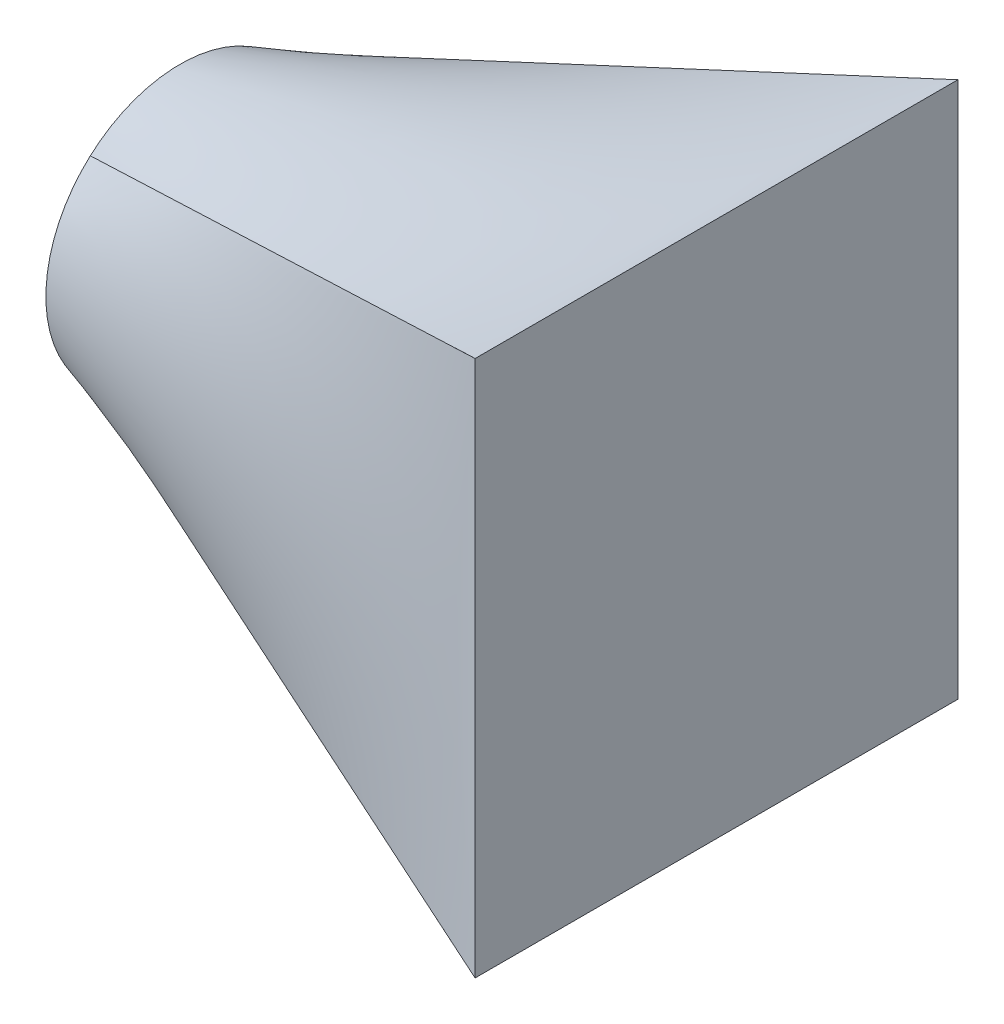
ISO-10303-21;
HEADER;
FILE_DESCRIPTION(('STEP AP214'),'2;1');
FILE_NAME('part.step','',(''),(''),'','','');
FILE_SCHEMA(('AUTOMOTIVE_DESIGN { 1 0 10303 214 1 1 1 1 }'));
ENDSEC;
DATA;
#1=APPLICATION_CONTEXT('core data for automotive mechanical design processes');
#2=APPLICATION_PROTOCOL_DEFINITION('international standard','automotive_design',2000,#1);
#3=PRODUCT_CONTEXT('',#1,'mechanical');
#4=PRODUCT('Part','Part','',(#3));
#5=PRODUCT_RELATED_PRODUCT_CATEGORY('part','',(#4));
#6=PRODUCT_DEFINITION_FORMATION('','',#4);
#7=PRODUCT_DEFINITION_CONTEXT('part definition',#1,'design');
#8=PRODUCT_DEFINITION('design','',#6,#7);
#9=PRODUCT_DEFINITION_SHAPE('','',#8);
#10=(LENGTH_UNIT() NAMED_UNIT(*) SI_UNIT(.MILLI.,.METRE.));
#11=(NAMED_UNIT(*) PLANE_ANGLE_UNIT() SI_UNIT($,.RADIAN.));
#12=(NAMED_UNIT(*) SI_UNIT($,.STERADIAN.) SOLID_ANGLE_UNIT());
#13=UNCERTAINTY_MEASURE_WITH_UNIT(LENGTH_MEASURE(1.E-05),#10,'distance_accuracy_value','');
#14=(GEOMETRIC_REPRESENTATION_CONTEXT(3) GLOBAL_UNCERTAINTY_ASSIGNED_CONTEXT((#13)) GLOBAL_UNIT_ASSIGNED_CONTEXT((#10,
#11,#12)) REPRESENTATION_CONTEXT('',''));
#15=CARTESIAN_POINT('',(0.,0.,0.));
#16=DIRECTION('',(0.,0.,1.));
#17=DIRECTION('',(1.,0.,0.));
#18=AXIS2_PLACEMENT_3D('',#15,#16,#17);
#19=CARTESIAN_POINT('',(100.,0.,0.));
#20=DIRECTION('',(1.,0.,0.));
#21=DIRECTION('',(0.,0.,-1.));
#22=AXIS2_PLACEMENT_3D('',#19,#20,#21);
#23=PLANE('',#22);
#24=DIRECTION('',(0.,1.,0.));
#25=VECTOR('',#24,1.);
#26=CARTESIAN_POINT('',(100.,50.,-45.));
#27=LINE('',#26,#25);
#28=CARTESIAN_POINT('',(100.,-50.,-45.));
#29=VERTEX_POINT('',#28);
#30=CARTESIAN_POINT('',(100.,50.,-45.));
#31=VERTEX_POINT('',#30);
#32=EDGE_CURVE('E138',#29,#31,#27,.T.);
#33=ORIENTED_EDGE('',*,*,#32,.T.);
#34=DIRECTION('',(0.,0.,1.));
#35=VECTOR('',#34,1.);
#36=CARTESIAN_POINT('',(100.,50.,45.));
#37=LINE('',#36,#35);
#38=CARTESIAN_POINT('',(100.,50.,45.));
#39=VERTEX_POINT('',#38);
#40=EDGE_CURVE('E12',#31,#39,#37,.T.);
#41=ORIENTED_EDGE('',*,*,#40,.T.);
#42=DIRECTION('',(0.,-1.,0.));
#43=VECTOR('',#42,1.);
#44=CARTESIAN_POINT('',(100.,50.,45.));
#45=LINE('',#44,#43);
#46=CARTESIAN_POINT('',(100.,-50.,45.));
#47=VERTEX_POINT('',#46);
#48=EDGE_CURVE('E75',#39,#47,#45,.T.);
#49=ORIENTED_EDGE('',*,*,#48,.T.);
#50=DIRECTION('',(0.,0.,-1.));
#51=VECTOR('',#50,1.);
#52=CARTESIAN_POINT('',(100.,-50.,45.));
#53=LINE('',#52,#51);
#54=EDGE_CURVE('E243',#47,#29,#53,.T.);
#55=ORIENTED_EDGE('',*,*,#54,.T.);
#56=EDGE_LOOP('',(#33,#41,#49,#55));
#57=FACE_BOUND('',#56,.T.);
#58=ADVANCED_FACE('F65',(#57),#23,.T.);
#59=CARTESIAN_POINT('',(0.,0.,0.));
#60=DIRECTION('',(1.,0.,0.));
#61=DIRECTION('',(0.,0.,-1.));
#62=AXIS2_PLACEMENT_3D('',#59,#60,#61);
#63=PLANE('',#62);
#64=CARTESIAN_POINT('',(0.,0.,0.));
#65=DIRECTION('',(1.,0.,0.));
#66=DIRECTION('',(0.,0.,-1.));
#67=AXIS2_PLACEMENT_3D('',#64,#65,#66);
#68=CIRCLE('',#67,25.);
#69=CARTESIAN_POINT('',(0.,18.5823536561792,-16.7241182905612));
#70=VERTEX_POINT('',#69);
#71=CARTESIAN_POINT('',(0.,18.5823536561792,16.7241182905612));
#72=VERTEX_POINT('',#71);
#73=EDGE_CURVE('E111',#70,#72,#68,.T.);
#74=ORIENTED_EDGE('',*,*,#73,.F.);
#75=CARTESIAN_POINT('',(0.,-18.5823536561792,-16.7241182905612));
#76=VERTEX_POINT('',#75);
#77=EDGE_CURVE('E115',#76,#70,#68,.T.);
#78=ORIENTED_EDGE('',*,*,#77,.F.);
#79=CARTESIAN_POINT('',(0.,-18.5823536561792,16.7241182905612));
#80=VERTEX_POINT('',#79);
#81=EDGE_CURVE('E131',#80,#76,#68,.T.);
#82=ORIENTED_EDGE('',*,*,#81,.F.);
#83=EDGE_CURVE('E117',#72,#80,#68,.T.);
#84=ORIENTED_EDGE('',*,*,#83,.F.);
#85=EDGE_LOOP('',(#74,#78,#82,#84));
#86=FACE_BOUND('',#85,.T.);
#87=ADVANCED_FACE('F113',(#86),#63,.F.);
#88=CARTESIAN_POINT('',(0.,-18.5823536561792,16.7241182905612));
#89=CARTESIAN_POINT('',(100.,-50.,45.));
#90=CARTESIAN_POINT('',(0.,-19.5146740981681,15.6882066883513));
#91=CARTESIAN_POINT('',(100.,-50.,41.25));
#92=CARTESIAN_POINT('',(0.,-20.3903816897098,14.5400365786379));
#93=CARTESIAN_POINT('',(100.,-50.,37.5));
#94=CARTESIAN_POINT('',(0.,-21.9602186850394,12.0386512726895));
#95=CARTESIAN_POINT('',(100.,-50.,30.));
#96=CARTESIAN_POINT('',(0.,-22.6539296752497,10.6853934167433));
#97=CARTESIAN_POINT('',(100.,-50.,26.25));
#98=CARTESIAN_POINT('',(0.,-23.7954475320854,7.82015594150865));
#99=CARTESIAN_POINT('',(100.,-50.,18.75));
#100=CARTESIAN_POINT('',(0.,-24.2428218090085,6.30837993883188));
#101=CARTESIAN_POINT('',(100.,-50.,15.));
#102=CARTESIAN_POINT('',(0.,-24.8452378208469,3.19753410326651));
#103=CARTESIAN_POINT('',(100.,-50.,7.50000000000003));
#104=CARTESIAN_POINT('',(0.,-25.,1.59890002179338));
#105=CARTESIAN_POINT('',(100.,-50.,3.75000000000003));
#106=CARTESIAN_POINT('',(0.,-25.,-1.59890002179338));
#107=CARTESIAN_POINT('',(100.,-50.,-3.74999999999997));
#108=CARTESIAN_POINT('',(0.,-24.8452378208469,-3.19753410326651));
#109=CARTESIAN_POINT('',(100.,-50.,-7.49999999999997));
#110=CARTESIAN_POINT('',(0.,-24.2428218090085,-6.30837993883188));
#111=CARTESIAN_POINT('',(100.,-50.,-15.));
#112=CARTESIAN_POINT('',(0.,-23.7954475320854,-7.82015594150865));
#113=CARTESIAN_POINT('',(100.,-50.,-18.75));
#114=CARTESIAN_POINT('',(0.,-22.6539296752497,-10.6853934167433));
#115=CARTESIAN_POINT('',(100.,-50.,-26.25));
#116=CARTESIAN_POINT('',(0.,-21.9602186850394,-12.0386512726895));
#117=CARTESIAN_POINT('',(100.,-50.,-30.));
#118=CARTESIAN_POINT('',(0.,-20.3903816897098,-14.5400365786379));
#119=CARTESIAN_POINT('',(100.,-50.,-37.5));
#120=CARTESIAN_POINT('',(0.,-19.5146740981681,-15.6882066883513));
#121=CARTESIAN_POINT('',(100.,-50.,-41.25));
#122=CARTESIAN_POINT('',(0.,-18.5823536561792,-16.7241182905612));
#123=CARTESIAN_POINT('',(100.,-50.,-45.));
#124=B_SPLINE_SURFACE_WITH_KNOTS('',3,1,((#88,#89),(#90,#91),(#92,#93),(#94,#95),(#96,#97),(#98,
#99),(#100,#101),(#102,#103),(#104,#105),(#106,#107),(#108,#109),(#110,#111),(#112,#113),(#114,
#115),(#116,#117),(#118,#119),(#120,#121),(#122,#123)),.UNSPECIFIED.,.F.,.F.,.F.,(4,2,2,2,2,2,2,
2,4),(2,2),(0.,0.125,0.25,0.375,0.5,0.625,0.75,0.875,1.),(0.,1.),.UNSPECIFIED.);
#125=DIRECTION('',(0.921097997551244,-0.289387311350666,-0.260448580215599));
#126=VECTOR('',#125,1.);
#127=CARTESIAN_POINT('',(50.,-34.2911768280896,-30.8620591452806));
#128=LINE('',#127,#126);
#129=EDGE_CURVE('E130',#76,#29,#128,.T.);
#130=DIRECTION('',(-0.921097997551244,0.289387311350666,-0.260448580215599));
#131=VECTOR('',#130,1.);
#132=CARTESIAN_POINT('',(50.,-34.2911768280896,30.8620591452806));
#133=LINE('',#132,#131);
#134=EDGE_CURVE('E122',#47,#80,#133,.T.);
#135=ORIENTED_EDGE('',*,*,#81,.T.);
#136=ORIENTED_EDGE('',*,*,#129,.T.);
#137=ORIENTED_EDGE('',*,*,#54,.F.);
#138=ORIENTED_EDGE('',*,*,#134,.T.);
#139=EDGE_LOOP('',(#135,#136,#137,#138));
#140=FACE_BOUND('',#139,.T.);
#141=ADVANCED_FACE('F204',(#140),#124,.T.);
#142=CARTESIAN_POINT('',(0.,-18.5823536561792,-16.7241182905612));
#143=CARTESIAN_POINT('',(100.,-50.,-45.));
#144=CARTESIAN_POINT('',(0.,-17.5464420539692,-17.8751311819056));
#145=CARTESIAN_POINT('',(100.,-45.8333333333333,-45.));
#146=CARTESIAN_POINT('',(0.,-16.3590611841905,-18.9780946346767));
#147=CARTESIAN_POINT('',(100.,-41.6666666666667,-45.));
#148=CARTESIAN_POINT('',(0.,-13.6904753884406,-20.9847049640765));
#149=CARTESIAN_POINT('',(100.,-33.3333333333333,-45.));
#150=CARTESIAN_POINT('',(0.,-12.2089905858558,-21.8875854426486));
#151=CARTESIAN_POINT('',(100.,-29.1666666666666,-45.));
#152=CARTESIAN_POINT('',(0.,-9.00708962245216,-23.3879923073331));
#153=CARTESIAN_POINT('',(100.,-20.8333333333333,-45.));
#154=CARTESIAN_POINT('',(0.,-7.28692740639666,-23.9845869158962));
#155=CARTESIAN_POINT('',(100.,-16.6666666666666,-45.));
#156=CARTESIAN_POINT('',(0.,-3.71079689829213,-24.7909198484425));
#157=CARTESIAN_POINT('',(100.,-8.33333333333326,-45.));
#158=CARTESIAN_POINT('',(0.,-1.85567668628072,-25.));
#159=CARTESIAN_POINT('',(100.,-4.16666666666659,-45.));
#160=CARTESIAN_POINT('',(0.,1.85567668628071,-25.));
#161=CARTESIAN_POINT('',(100.,4.16666666666675,-45.));
#162=CARTESIAN_POINT('',(0.,3.71079689829212,-24.7909198484425));
#163=CARTESIAN_POINT('',(100.,8.33333333333341,-45.));
#164=CARTESIAN_POINT('',(0.,7.28692740639665,-23.9845869158962));
#165=CARTESIAN_POINT('',(100.,16.6666666666667,-45.));
#166=CARTESIAN_POINT('',(0.,9.00708962245216,-23.3879923073331));
#167=CARTESIAN_POINT('',(100.,20.8333333333334,-45.));
#168=CARTESIAN_POINT('',(0.,12.2089905858558,-21.8875854426486));
#169=CARTESIAN_POINT('',(100.,29.1666666666667,-45.));
#170=CARTESIAN_POINT('',(0.,13.6904753884406,-20.9847049640765));
#171=CARTESIAN_POINT('',(100.,33.3333333333334,-45.));
#172=CARTESIAN_POINT('',(0.,16.3590611841905,-18.9780946346767));
#173=CARTESIAN_POINT('',(100.,41.6666666666667,-45.));
#174=CARTESIAN_POINT('',(0.,17.5464420539692,-17.8751311819056));
#175=CARTESIAN_POINT('',(100.,45.8333333333333,-45.));
#176=CARTESIAN_POINT('',(0.,18.5823536561792,-16.7241182905612));
#177=CARTESIAN_POINT('',(100.,50.,-45.));
#178=B_SPLINE_SURFACE_WITH_KNOTS('',3,1,((#142,#143),(#144,#145),(#146,#147),(#148,#149),(#150,
#151),(#152,#153),(#154,#155),(#156,#157),(#158,#159),(#160,#161),(#162,#163),(#164,#165),(#166,
#167),(#168,#169),(#170,#171),(#172,#173),(#174,#175),(#176,#177)),.UNSPECIFIED.,.F.,.F.,.F.,(4,
2,2,2,2,2,2,2,4),(2,2),(0.,0.125,0.25,0.375,0.5,0.625,0.75,0.875,1.),(0.,1.),.UNSPECIFIED.);
#179=DIRECTION('',(0.921097997551244,0.289387311350665,-0.260448580215599));
#180=VECTOR('',#179,1.);
#181=CARTESIAN_POINT('',(50.,34.2911768280896,-30.8620591452806));
#182=LINE('',#181,#180);
#183=EDGE_CURVE('E83',#70,#31,#182,.T.);
#184=ORIENTED_EDGE('',*,*,#77,.T.);
#185=ORIENTED_EDGE('',*,*,#183,.T.);
#186=ORIENTED_EDGE('',*,*,#32,.F.);
#187=ORIENTED_EDGE('',*,*,#129,.F.);
#188=EDGE_LOOP('',(#184,#185,#186,#187));
#189=FACE_BOUND('',#188,.T.);
#190=ADVANCED_FACE('F128',(#189),#178,.T.);
#191=CARTESIAN_POINT('',(0.,18.5823536561792,16.7241182905612));
#192=CARTESIAN_POINT('',(100.,50.,45.));
#193=CARTESIAN_POINT('',(0.,17.5464420539692,17.8751311819056));
#194=CARTESIAN_POINT('',(100.,45.8333333333333,45.));
#195=CARTESIAN_POINT('',(0.,16.3590611841905,18.9780946346767));
#196=CARTESIAN_POINT('',(100.,41.6666666666666,45.));
#197=CARTESIAN_POINT('',(0.,13.6904753884406,20.9847049640765));
#198=CARTESIAN_POINT('',(100.,33.3333333333333,45.));
#199=CARTESIAN_POINT('',(0.,12.2089905858558,21.8875854426486));
#200=CARTESIAN_POINT('',(100.,29.1666666666666,45.));
#201=CARTESIAN_POINT('',(0.,9.00708962245216,23.3879923073331));
#202=CARTESIAN_POINT('',(100.,20.8333333333333,45.));
#203=CARTESIAN_POINT('',(0.,7.28692740639666,23.9845869158963));
#204=CARTESIAN_POINT('',(100.,16.6666666666667,45.));
#205=CARTESIAN_POINT('',(0.,3.71079689829212,24.7909198484425));
#206=CARTESIAN_POINT('',(100.,8.33333333333332,45.));
#207=CARTESIAN_POINT('',(0.,1.85567668628071,25.));
#208=CARTESIAN_POINT('',(100.,4.16666666666666,45.));
#209=CARTESIAN_POINT('',(0.,-1.85567668628071,25.));
#210=CARTESIAN_POINT('',(100.,-4.16666666666667,45.));
#211=CARTESIAN_POINT('',(0.,-3.71079689829212,24.7909198484425));
#212=CARTESIAN_POINT('',(100.,-8.33333333333334,45.));
#213=CARTESIAN_POINT('',(0.,-7.28692740639666,23.9845869158963));
#214=CARTESIAN_POINT('',(100.,-16.6666666666667,45.));
#215=CARTESIAN_POINT('',(0.,-9.00708962245217,23.3879923073331));
#216=CARTESIAN_POINT('',(100.,-20.8333333333333,45.));
#217=CARTESIAN_POINT('',(0.,-12.2089905858558,21.8875854426486));
#218=CARTESIAN_POINT('',(100.,-29.1666666666667,45.));
#219=CARTESIAN_POINT('',(0.,-13.6904753884406,20.9847049640765));
#220=CARTESIAN_POINT('',(100.,-33.3333333333333,45.));
#221=CARTESIAN_POINT('',(0.,-16.3590611841905,18.9780946346767));
#222=CARTESIAN_POINT('',(100.,-41.6666666666667,45.));
#223=CARTESIAN_POINT('',(0.,-17.5464420539692,17.8751311819056));
#224=CARTESIAN_POINT('',(100.,-45.8333333333333,45.));
#225=CARTESIAN_POINT('',(0.,-18.5823536561792,16.7241182905612));
#226=CARTESIAN_POINT('',(100.,-50.,45.));
#227=B_SPLINE_SURFACE_WITH_KNOTS('',3,1,((#191,#192),(#193,#194),(#195,#196),(#197,#198),(#199,
#200),(#201,#202),(#203,#204),(#205,#206),(#207,#208),(#209,#210),(#211,#212),(#213,#214),(#215,
#216),(#217,#218),(#219,#220),(#221,#222),(#223,#224),(#225,#226)),.UNSPECIFIED.,.F.,.F.,.F.,(4,
2,2,2,2,2,2,2,4),(2,2),(0.,0.125,0.25,0.375,0.5,0.625,0.75,0.875,1.),(0.,1.),.UNSPECIFIED.);
#228=DIRECTION('',(0.921097997551244,0.289387311350665,0.260448580215599));
#229=VECTOR('',#228,1.);
#230=CARTESIAN_POINT('',(50.,34.2911768280896,30.8620591452806));
#231=LINE('',#230,#229);
#232=EDGE_CURVE('E136',#72,#39,#231,.T.);
#233=ORIENTED_EDGE('',*,*,#83,.T.);
#234=ORIENTED_EDGE('',*,*,#134,.F.);
#235=ORIENTED_EDGE('',*,*,#48,.F.);
#236=ORIENTED_EDGE('',*,*,#232,.F.);
#237=EDGE_LOOP('',(#233,#234,#235,#236));
#238=FACE_BOUND('',#237,.T.);
#239=ADVANCED_FACE('F163',(#238),#227,.T.);
#240=CARTESIAN_POINT('',(0.,18.5823536561792,-16.7241182905612));
#241=CARTESIAN_POINT('',(100.,50.,-45.));
#242=CARTESIAN_POINT('',(0.,19.5146740981681,-15.6882066883513));
#243=CARTESIAN_POINT('',(100.,50.,-41.25));
#244=CARTESIAN_POINT('',(0.,20.3903816897098,-14.5400365786379));
#245=CARTESIAN_POINT('',(100.,50.,-37.5));
#246=CARTESIAN_POINT('',(0.,21.9602186850394,-12.0386512726895));
#247=CARTESIAN_POINT('',(100.,50.,-30.));
#248=CARTESIAN_POINT('',(0.,22.6539296752497,-10.6853934167433));
#249=CARTESIAN_POINT('',(100.,50.,-26.25));
#250=CARTESIAN_POINT('',(0.,23.7954475320854,-7.82015594150865));
#251=CARTESIAN_POINT('',(100.,50.,-18.75));
#252=CARTESIAN_POINT('',(0.,24.2428218090085,-6.30837993883188));
#253=CARTESIAN_POINT('',(100.,50.,-15.));
#254=CARTESIAN_POINT('',(0.,24.8452378208469,-3.19753410326651));
#255=CARTESIAN_POINT('',(100.,50.,-7.49999999999999));
#256=CARTESIAN_POINT('',(0.,25.,-1.59890002179338));
#257=CARTESIAN_POINT('',(100.,50.,-3.74999999999999));
#258=CARTESIAN_POINT('',(0.,25.,1.59890002179339));
#259=CARTESIAN_POINT('',(100.,50.,3.75000000000001));
#260=CARTESIAN_POINT('',(0.,24.8452378208469,3.19753410326651));
#261=CARTESIAN_POINT('',(100.,50.,7.50000000000001));
#262=CARTESIAN_POINT('',(0.,24.2428218090085,6.30837993883188));
#263=CARTESIAN_POINT('',(100.,50.,15.));
#264=CARTESIAN_POINT('',(0.,23.7954475320854,7.82015594150865));
#265=CARTESIAN_POINT('',(100.,50.,18.75));
#266=CARTESIAN_POINT('',(0.,22.6539296752497,10.6853934167433));
#267=CARTESIAN_POINT('',(100.,50.,26.25));
#268=CARTESIAN_POINT('',(0.,21.9602186850394,12.0386512726895));
#269=CARTESIAN_POINT('',(100.,50.,30.));
#270=CARTESIAN_POINT('',(0.,20.3903816897098,14.5400365786379));
#271=CARTESIAN_POINT('',(100.,50.,37.5));
#272=CARTESIAN_POINT('',(0.,19.5146740981681,15.6882066883513));
#273=CARTESIAN_POINT('',(100.,50.,41.25));
#274=CARTESIAN_POINT('',(0.,18.5823536561792,16.7241182905612));
#275=CARTESIAN_POINT('',(100.,50.,45.));
#276=B_SPLINE_SURFACE_WITH_KNOTS('',3,1,((#240,#241),(#242,#243),(#244,#245),(#246,#247),(#248,
#249),(#250,#251),(#252,#253),(#254,#255),(#256,#257),(#258,#259),(#260,#261),(#262,#263),(#264,
#265),(#266,#267),(#268,#269),(#270,#271),(#272,#273),(#274,#275)),.UNSPECIFIED.,.F.,.F.,.F.,(4,
2,2,2,2,2,2,2,4),(2,2),(0.,0.125,0.25,0.375,0.5,0.625,0.75,0.875,1.),(0.,1.),.UNSPECIFIED.);
#277=ORIENTED_EDGE('',*,*,#73,.T.);
#278=ORIENTED_EDGE('',*,*,#232,.T.);
#279=ORIENTED_EDGE('',*,*,#40,.F.);
#280=ORIENTED_EDGE('',*,*,#183,.F.);
#281=EDGE_LOOP('',(#277,#278,#279,#280));
#282=FACE_BOUND('',#281,.T.);
#283=ADVANCED_FACE('F134',(#282),#276,.T.);
#284=CLOSED_SHELL('',(#58,#87,#141,#190,#239,#283));
#285=MANIFOLD_SOLID_BREP('B2',#284);
#286=ADVANCED_BREP_SHAPE_REPRESENTATION('',(#18,#285),#14);
#287=SHAPE_DEFINITION_REPRESENTATION(#9,#286);
ENDSEC;
END-ISO-10303-21;
